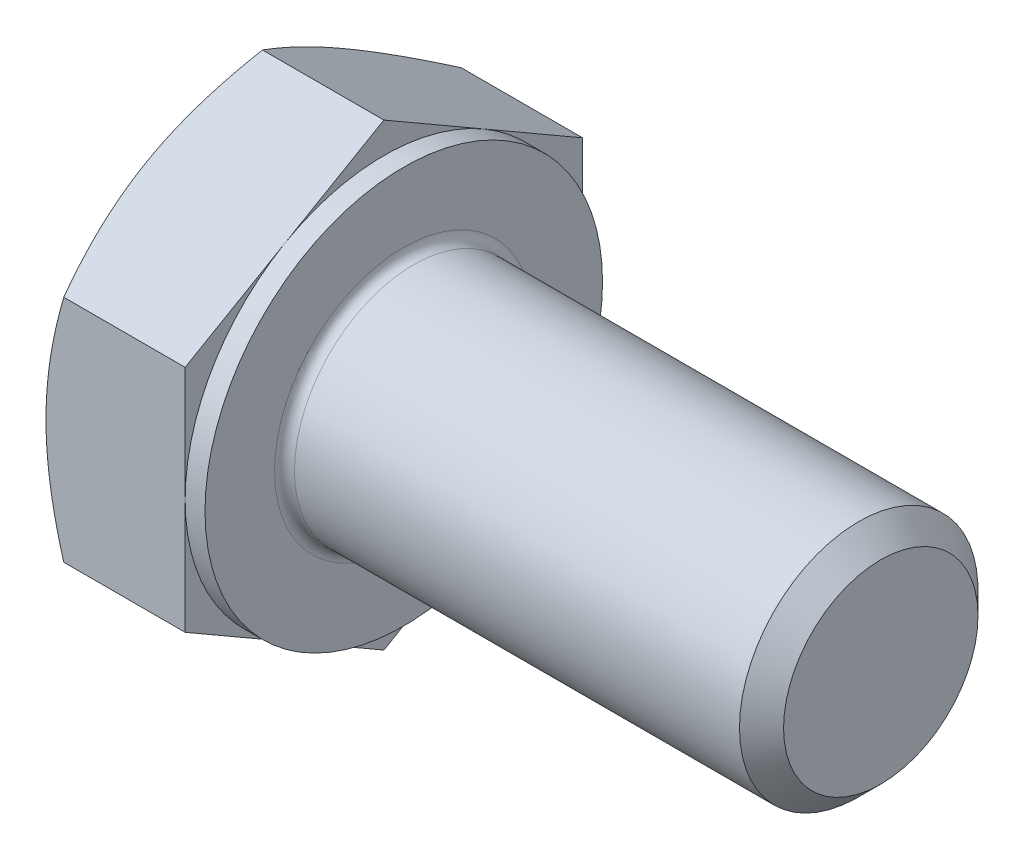
ISO-10303-21;
HEADER;
FILE_DESCRIPTION(('STEP AP214'),'2;1');
FILE_NAME('part.step','',(''),(''),'','','');
FILE_SCHEMA(('AUTOMOTIVE_DESIGN { 1 0 10303 214 1 1 1 1 }'));
ENDSEC;
DATA;
#1=APPLICATION_CONTEXT('core data for automotive mechanical design processes');
#2=APPLICATION_PROTOCOL_DEFINITION('international standard','automotive_design',2000,#1);
#3=PRODUCT_CONTEXT('',#1,'mechanical');
#4=PRODUCT('Part','Part','',(#3));
#5=PRODUCT_RELATED_PRODUCT_CATEGORY('part','',(#4));
#6=PRODUCT_DEFINITION_FORMATION('','',#4);
#7=PRODUCT_DEFINITION_CONTEXT('part definition',#1,'design');
#8=PRODUCT_DEFINITION('design','',#6,#7);
#9=PRODUCT_DEFINITION_SHAPE('','',#8);
#10=(LENGTH_UNIT() NAMED_UNIT(*) SI_UNIT(.MILLI.,.METRE.));
#11=(NAMED_UNIT(*) PLANE_ANGLE_UNIT() SI_UNIT($,.RADIAN.));
#12=(NAMED_UNIT(*) SI_UNIT($,.STERADIAN.) SOLID_ANGLE_UNIT());
#13=UNCERTAINTY_MEASURE_WITH_UNIT(LENGTH_MEASURE(1.E-05),#10,'distance_accuracy_value','');
#14=(GEOMETRIC_REPRESENTATION_CONTEXT(3) GLOBAL_UNCERTAINTY_ASSIGNED_CONTEXT((#13)) GLOBAL_UNIT_ASSIGNED_CONTEXT((#10,
#11,#12)) REPRESENTATION_CONTEXT('',''));
#15=CARTESIAN_POINT('',(0.,0.,0.));
#16=DIRECTION('',(0.,0.,1.));
#17=DIRECTION('',(1.,0.,0.));
#18=AXIS2_PLACEMENT_3D('',#15,#16,#17);
#19=CARTESIAN_POINT('',(4.,0.,-9.99999999999999));
#20=DIRECTION('',(1.,0.,0.));
#21=DIRECTION('',(0.,0.,-1.));
#22=AXIS2_PLACEMENT_3D('',#19,#20,#21);
#23=PLANE('',#22);
#24=CARTESIAN_POINT('',(4.,0.,0.));
#25=DIRECTION('',(1.,0.,0.));
#26=DIRECTION('',(0.,0.,-1.));
#27=AXIS2_PLACEMENT_3D('',#24,#25,#26);
#28=CIRCLE('',#27,3.25);
#29=CARTESIAN_POINT('',(4.,0.,-3.25));
#30=VERTEX_POINT('',#29);
#31=EDGE_CURVE('E46',#30,#30,#28,.F.);
#32=ORIENTED_EDGE('',*,*,#31,.T.);
#33=EDGE_LOOP('',(#32));
#34=FACE_BOUND('',#33,.T.);
#35=CARTESIAN_POINT('',(4.,0.,0.));
#36=DIRECTION('',(1.,0.,0.));
#37=DIRECTION('',(0.,0.,-1.));
#38=AXIS2_PLACEMENT_3D('',#35,#36,#37);
#39=CIRCLE('',#38,5.);
#40=CARTESIAN_POINT('',(4.,0.,-5.));
#41=VERTEX_POINT('',#40);
#42=EDGE_CURVE('E297',#41,#41,#39,.T.);
#43=ORIENTED_EDGE('',*,*,#42,.T.);
#44=EDGE_LOOP('',(#43));
#45=FACE_BOUND('',#44,.T.);
#46=ADVANCED_FACE('F38',(#34,#45),#23,.T.);
#47=CARTESIAN_POINT('',(0.,0.,0.));
#48=DIRECTION('',(-1.,0.,0.));
#49=DIRECTION('',(0.,0.,1.));
#50=AXIS2_PLACEMENT_3D('',#47,#48,#49);
#51=CYLINDRICAL_SURFACE('',#50,3.);
#52=CARTESIAN_POINT('',(4.25,0.,0.));
#53=DIRECTION('',(1.,0.,0.));
#54=DIRECTION('',(0.,0.,-1.));
#55=AXIS2_PLACEMENT_3D('',#52,#53,#54);
#56=CIRCLE('',#55,3.);
#57=CARTESIAN_POINT('',(4.25,0.,-3.));
#58=VERTEX_POINT('',#57);
#59=EDGE_CURVE('E11',#58,#58,#56,.T.);
#60=ORIENTED_EDGE('',*,*,#59,.T.);
#61=EDGE_LOOP('',(#60));
#62=FACE_BOUND('',#61,.T.);
#63=CARTESIAN_POINT('',(15.4455,0.,0.));
#64=DIRECTION('',(-1.,0.,0.));
#65=DIRECTION('',(0.,0.,1.));
#66=AXIS2_PLACEMENT_3D('',#63,#64,#65);
#67=CIRCLE('',#66,3.);
#68=CARTESIAN_POINT('',(15.4455,0.,3.));
#69=VERTEX_POINT('',#68);
#70=EDGE_CURVE('E276',#69,#69,#67,.T.);
#71=ORIENTED_EDGE('',*,*,#70,.T.);
#72=EDGE_LOOP('',(#71));
#73=FACE_BOUND('',#72,.T.);
#74=ADVANCED_FACE('F250',(#62,#73),#51,.T.);
#75=CARTESIAN_POINT('',(16.,0.,0.));
#76=DIRECTION('',(-1.,0.,0.));
#77=DIRECTION('',(0.,0.,1.));
#78=AXIS2_PLACEMENT_3D('',#75,#76,#77);
#79=CONICAL_SURFACE('',#78,2.4455,0.78539816339745);
#80=ORIENTED_EDGE('',*,*,#70,.F.);
#81=EDGE_LOOP('',(#80));
#82=FACE_BOUND('',#81,.T.);
#83=CARTESIAN_POINT('',(16.,0.,0.));
#84=DIRECTION('',(-1.,0.,0.));
#85=DIRECTION('',(0.,0.,1.));
#86=AXIS2_PLACEMENT_3D('',#83,#84,#85);
#87=CIRCLE('',#86,2.4455);
#88=CARTESIAN_POINT('',(16.,0.,2.4455));
#89=VERTEX_POINT('',#88);
#90=EDGE_CURVE('E274',#89,#89,#87,.T.);
#91=ORIENTED_EDGE('',*,*,#90,.T.);
#92=EDGE_LOOP('',(#91));
#93=FACE_BOUND('',#92,.T.);
#94=ADVANCED_FACE('F255',(#82,#93),#79,.T.);
#95=CARTESIAN_POINT('',(16.,0.,0.));
#96=DIRECTION('',(-1.,0.,0.));
#97=DIRECTION('',(0.,0.,1.));
#98=AXIS2_PLACEMENT_3D('',#95,#96,#97);
#99=PLANE('',#98);
#100=ORIENTED_EDGE('',*,*,#90,.F.);
#101=EDGE_LOOP('',(#100));
#102=FACE_BOUND('',#101,.T.);
#103=ADVANCED_FACE('F262',(#102),#99,.F.);
#104=CARTESIAN_POINT('',(3.5,5.,0.));
#105=DIRECTION('',(1.,0.,0.));
#106=DIRECTION('',(0.,0.,-1.));
#107=AXIS2_PLACEMENT_3D('',#104,#105,#106);
#108=PLANE('',#107);
#109=DIRECTION('',(0.,0.500000000000001,0.866025403784438));
#110=VECTOR('',#109,1.);
#111=CARTESIAN_POINT('',(3.5,2.88675134594813,-5.));
#112=LINE('',#111,#110);
#113=CARTESIAN_POINT('',(3.5,2.88675134594813,-5.));
#114=VERTEX_POINT('',#113);
#115=CARTESIAN_POINT('',(3.5,4.33012701892219,-2.50000000000001));
#116=VERTEX_POINT('',#115);
#117=EDGE_CURVE('E170',#114,#116,#112,.T.);
#118=ORIENTED_EDGE('',*,*,#117,.T.);
#119=CARTESIAN_POINT('',(3.5,0.,0.));
#120=DIRECTION('',(-1.,0.,0.));
#121=DIRECTION('',(0.,0.,1.));
#122=AXIS2_PLACEMENT_3D('',#119,#120,#121);
#123=CIRCLE('',#122,5.);
#124=CARTESIAN_POINT('',(3.5,0.,-5.));
#125=VERTEX_POINT('',#124);
#126=EDGE_CURVE('E53',#116,#125,#123,.T.);
#127=ORIENTED_EDGE('',*,*,#126,.T.);
#128=DIRECTION('',(0.,1.,0.));
#129=VECTOR('',#128,1.);
#130=CARTESIAN_POINT('',(3.5,2.88675134594813,-5.));
#131=LINE('',#130,#129);
#132=EDGE_CURVE('E300',#125,#114,#131,.T.);
#133=ORIENTED_EDGE('',*,*,#132,.T.);
#134=EDGE_LOOP('',(#118,#127,#133));
#135=FACE_BOUND('',#134,.T.);
#136=ADVANCED_FACE('F265',(#135),#108,.T.);
#137=CARTESIAN_POINT('',(3.5,5.77350269189626,0.));
#138=VERTEX_POINT('',#137);
#139=EDGE_CURVE('E168',#116,#138,#112,.T.);
#140=ORIENTED_EDGE('',*,*,#139,.T.);
#141=DIRECTION('',(0.,-0.500000000000001,0.866025403784438));
#142=VECTOR('',#141,1.);
#143=CARTESIAN_POINT('',(3.5,5.77350269189626,0.));
#144=LINE('',#143,#142);
#145=CARTESIAN_POINT('',(3.5,4.33012701892219,2.5));
#146=VERTEX_POINT('',#145);
#147=EDGE_CURVE('E167',#138,#146,#144,.T.);
#148=ORIENTED_EDGE('',*,*,#147,.T.);
#149=EDGE_CURVE('E156',#146,#116,#123,.T.);
#150=ORIENTED_EDGE('',*,*,#149,.T.);
#151=EDGE_LOOP('',(#140,#148,#150));
#152=FACE_BOUND('',#151,.T.);
#153=ADVANCED_FACE('F270',(#152),#108,.T.);
#154=CARTESIAN_POINT('',(3.5,2.88675134594812,5.));
#155=VERTEX_POINT('',#154);
#156=EDGE_CURVE('E135',#146,#155,#144,.T.);
#157=ORIENTED_EDGE('',*,*,#156,.T.);
#158=DIRECTION('',(0.,-1.,0.));
#159=VECTOR('',#158,1.);
#160=CARTESIAN_POINT('',(3.5,2.88675134594812,5.));
#161=LINE('',#160,#159);
#162=CARTESIAN_POINT('',(3.5,0.,5.));
#163=VERTEX_POINT('',#162);
#164=EDGE_CURVE('E129',#155,#163,#161,.T.);
#165=ORIENTED_EDGE('',*,*,#164,.T.);
#166=EDGE_CURVE('E133',#163,#146,#123,.T.);
#167=ORIENTED_EDGE('',*,*,#166,.T.);
#168=EDGE_LOOP('',(#157,#165,#167));
#169=FACE_BOUND('',#168,.T.);
#170=ADVANCED_FACE('F131',(#169),#108,.T.);
#171=CARTESIAN_POINT('',(3.5,-2.88675134594814,5.));
#172=VERTEX_POINT('',#171);
#173=EDGE_CURVE('E139',#163,#172,#161,.T.);
#174=ORIENTED_EDGE('',*,*,#173,.T.);
#175=DIRECTION('',(0.,-0.500000000000001,-0.866025403784438));
#176=VECTOR('',#175,1.);
#177=CARTESIAN_POINT('',(3.5,-5.77350269189627,0.));
#178=LINE('',#177,#176);
#179=CARTESIAN_POINT('',(3.5,-4.33012701892219,2.50000000000001));
#180=VERTEX_POINT('',#179);
#181=EDGE_CURVE('E146',#172,#180,#178,.T.);
#182=ORIENTED_EDGE('',*,*,#181,.T.);
#183=EDGE_CURVE('E143',#180,#163,#123,.T.);
#184=ORIENTED_EDGE('',*,*,#183,.T.);
#185=EDGE_LOOP('',(#174,#182,#184));
#186=FACE_BOUND('',#185,.T.);
#187=ADVANCED_FACE('F144',(#186),#108,.T.);
#188=CARTESIAN_POINT('',(3.5,-5.77350269189627,0.));
#189=VERTEX_POINT('',#188);
#190=EDGE_CURVE('E162',#180,#189,#178,.T.);
#191=ORIENTED_EDGE('',*,*,#190,.T.);
#192=DIRECTION('',(0.,0.500000000000001,-0.866025403784438));
#193=VECTOR('',#192,1.);
#194=CARTESIAN_POINT('',(3.5,-2.88675134594814,-5.));
#195=LINE('',#194,#193);
#196=CARTESIAN_POINT('',(3.5,-4.33012701892219,-2.50000000000001));
#197=VERTEX_POINT('',#196);
#198=EDGE_CURVE('E338',#189,#197,#195,.T.);
#199=ORIENTED_EDGE('',*,*,#198,.T.);
#200=EDGE_CURVE('E150',#197,#180,#123,.T.);
#201=ORIENTED_EDGE('',*,*,#200,.T.);
#202=EDGE_LOOP('',(#191,#199,#201));
#203=FACE_BOUND('',#202,.T.);
#204=ADVANCED_FACE('F339',(#203),#108,.T.);
#205=CARTESIAN_POINT('',(3.5,-2.88675134594814,-5.));
#206=VERTEX_POINT('',#205);
#207=EDGE_CURVE('E157',#197,#206,#195,.T.);
#208=ORIENTED_EDGE('',*,*,#207,.T.);
#209=EDGE_CURVE('E301',#206,#125,#131,.T.);
#210=ORIENTED_EDGE('',*,*,#209,.T.);
#211=EDGE_CURVE('E308',#125,#197,#123,.T.);
#212=ORIENTED_EDGE('',*,*,#211,.T.);
#213=EDGE_LOOP('',(#208,#210,#212));
#214=FACE_BOUND('',#213,.T.);
#215=ADVANCED_FACE('F271',(#214),#108,.T.);
#216=CARTESIAN_POINT('',(0.,0.,0.));
#217=DIRECTION('',(-1.,0.,0.));
#218=DIRECTION('',(0.,0.,1.));
#219=AXIS2_PLACEMENT_3D('',#216,#217,#218);
#220=CYLINDRICAL_SURFACE('',#219,5.);
#221=ORIENTED_EDGE('',*,*,#126,.F.);
#222=ORIENTED_EDGE('',*,*,#149,.F.);
#223=ORIENTED_EDGE('',*,*,#166,.F.);
#224=ORIENTED_EDGE('',*,*,#183,.F.);
#225=ORIENTED_EDGE('',*,*,#200,.F.);
#226=ORIENTED_EDGE('',*,*,#211,.F.);
#227=EDGE_LOOP('',(#221,#222,#223,#224,#225,#226));
#228=FACE_BOUND('',#227,.T.);
#229=ORIENTED_EDGE('',*,*,#42,.F.);
#230=EDGE_LOOP('',(#229));
#231=FACE_BOUND('',#230,.T.);
#232=ADVANCED_FACE('F153',(#228,#231),#220,.T.);
#233=CARTESIAN_POINT('',(0.,0.,-9.99999999999999));
#234=DIRECTION('',(1.,0.,0.));
#235=DIRECTION('',(0.,0.,-1.));
#236=AXIS2_PLACEMENT_3D('',#233,#234,#235);
#237=PLANE('',#236);
#238=CARTESIAN_POINT('',(0.,0.,0.));
#239=DIRECTION('',(1.,0.,0.));
#240=DIRECTION('',(0.,0.,-1.));
#241=AXIS2_PLACEMENT_3D('',#238,#239,#240);
#242=CIRCLE('',#241,5.);
#243=CARTESIAN_POINT('',(0.,0.,-5.));
#244=VERTEX_POINT('',#243);
#245=CARTESIAN_POINT('',(0.,4.33012701892219,-2.50000000000001));
#246=VERTEX_POINT('',#245);
#247=EDGE_CURVE('E296',#244,#246,#242,.T.);
#248=ORIENTED_EDGE('',*,*,#247,.F.);
#249=CARTESIAN_POINT('',(0.,-4.33012701892219,-2.50000000000001));
#250=VERTEX_POINT('',#249);
#251=EDGE_CURVE('E292',#250,#244,#242,.T.);
#252=ORIENTED_EDGE('',*,*,#251,.F.);
#253=CARTESIAN_POINT('',(0.,-4.33012701892219,2.50000000000001));
#254=VERTEX_POINT('',#253);
#255=EDGE_CURVE('E295',#254,#250,#242,.T.);
#256=ORIENTED_EDGE('',*,*,#255,.F.);
#257=CARTESIAN_POINT('',(0.,0.,5.));
#258=VERTEX_POINT('',#257);
#259=EDGE_CURVE('E331',#258,#254,#242,.T.);
#260=ORIENTED_EDGE('',*,*,#259,.F.);
#261=CARTESIAN_POINT('',(0.,0.,0.));
#262=DIRECTION('',(-1.,0.,0.));
#263=DIRECTION('',(0.,0.,1.));
#264=AXIS2_PLACEMENT_3D('',#261,#262,#263);
#265=CIRCLE('',#264,5.);
#266=CARTESIAN_POINT('',(0.,4.33012701892219,2.5));
#267=VERTEX_POINT('',#266);
#268=EDGE_CURVE('E171',#258,#267,#265,.T.);
#269=ORIENTED_EDGE('',*,*,#268,.T.);
#270=EDGE_CURVE('E354',#246,#267,#242,.T.);
#271=ORIENTED_EDGE('',*,*,#270,.F.);
#272=EDGE_LOOP('',(#248,#252,#256,#260,#269,#271));
#273=FACE_BOUND('',#272,.T.);
#274=ADVANCED_FACE('F200',(#273),#237,.F.);
#275=CARTESIAN_POINT('',(0.,0.,0.));
#276=DIRECTION('',(1.,0.,0.));
#277=DIRECTION('',(0.,0.,-1.));
#278=AXIS2_PLACEMENT_3D('',#275,#276,#277);
#279=CONICAL_SURFACE('',#278,5.,1.0471975511966);
#280=CARTESIAN_POINT('',(0.446648656051827,2.88663587589429,5.0002));
#281=CARTESIAN_POINT('',(0.373386567637633,3.01349970319368,4.78046540547482));
#282=CARTESIAN_POINT('',(0.30675132191809,3.14144859993849,4.55885141554042));
#283=CARTESIAN_POINT('',(0.19043899101081,3.3995619353212,4.11178600454649));
#284=CARTESIAN_POINT('',(0.140803049915788,3.52973095989717,3.88632664040923));
#285=CARTESIAN_POINT('',(0.0635510254186972,3.78847564779797,3.43816769477649));
#286=CARTESIAN_POINT('',(0.0354203782834881,3.91701101576052,3.21553790689581));
#287=CARTESIAN_POINT('',(0.0101949219536836,4.11026620624322,2.88081009815336));
#288=CARTESIAN_POINT('',(0.00461345976948329,4.1747286887931,2.76915780319494));
#289=CARTESIAN_POINT('',(-0.000797783248530234,4.30371322717528,2.54575002932621));
#290=CARTESIAN_POINT('',(-0.000627741741797061,4.36823528110588,2.43399455370969));
#291=CARTESIAN_POINT('',(0.0077536317920362,4.54500768479194,2.12781576914936));
#292=CARTESIAN_POINT('',(0.0218297718972513,4.65719946015292,1.93349391403279));
#293=CARTESIAN_POINT('',(0.066465257109431,4.88083840557981,1.5461398980023));
#294=CARTESIAN_POINT('',(0.0970398601475084,4.9922847895602,1.35310909862843));
#295=CARTESIAN_POINT('',(0.173468493621164,5.21637431361295,0.964974657525146));
#296=CARTESIAN_POINT('',(0.219646378878681,5.32898917185759,0.769920001358265));
#297=CARTESIAN_POINT('',(0.324451794491935,5.55253939626498,0.382719654641232));
#298=CARTESIAN_POINT('',(0.383054703437375,5.66347762579592,0.190569004591913));
#299=CARTESIAN_POINT('',(0.44664865605183,5.7736181619501,-0.000200000000000191));
#300=B_SPLINE_CURVE_WITH_KNOTS('',3,(#280,#281,#282,#283,#284,#285,#286,#287,#288,#289,#290,
#291,#292,#293,#294,#295,#296,#297,#298,#299),.UNSPECIFIED.,.F.,.F.,(4,2,2,2,2,2,2,2,2,4),(0.,
0.792555841363091,1.58701660053333,2.3618153748728,2.74884076077325,3.13585419177295,
3.80962362599679,4.48401723901189,5.17336882348929,5.86136694793726),.UNSPECIFIED.);
#301=CARTESIAN_POINT('',(0.446581987385203,5.77350269189626,0.));
#302=VERTEX_POINT('',#301);
#303=EDGE_CURVE('E219',#267,#302,#300,.T.);
#304=ORIENTED_EDGE('',*,*,#303,.T.);
#305=CARTESIAN_POINT('',(0.44664865605183,5.7736181619501,0.000200000000000014));
#306=CARTESIAN_POINT('',(0.373386567637636,5.64675433465071,-0.219534594525184));
#307=CARTESIAN_POINT('',(0.306751321918093,5.5188054379059,-0.44114858445958));
#308=CARTESIAN_POINT('',(0.190438991010811,5.26069210252318,-0.888213995453513));
#309=CARTESIAN_POINT('',(0.140803049915789,5.13052307794721,-1.11367335959077));
#310=CARTESIAN_POINT('',(0.0635510254186982,4.87177839004641,-1.56183230522351));
#311=CARTESIAN_POINT('',(0.0354203782834897,4.74324302208387,-1.78446209310419));
#312=CARTESIAN_POINT('',(0.0101949219536841,4.54998783160116,-2.11918990184664));
#313=CARTESIAN_POINT('',(0.00461345976948316,4.48552534905128,-2.23084219680506));
#314=CARTESIAN_POINT('',(-0.000797783248530588,4.35654081066911,-2.4542499706738));
#315=CARTESIAN_POINT('',(-0.000627741741797015,4.2920187567385,-2.56600544629031));
#316=CARTESIAN_POINT('',(0.00775363179203648,4.11524635305244,-2.87218423085064));
#317=CARTESIAN_POINT('',(0.0218297718972508,4.00305457769146,-3.06650608596721));
#318=CARTESIAN_POINT('',(0.0664652571094295,3.77941563226457,-3.45386010199771));
#319=CARTESIAN_POINT('',(0.0970398601475067,3.66796924828418,-3.64689090137157));
#320=CARTESIAN_POINT('',(0.173468493621162,3.44387972423144,-4.03502534247485));
#321=CARTESIAN_POINT('',(0.219646378878679,3.3312648659868,-4.23007999864174));
#322=CARTESIAN_POINT('',(0.324451794491932,3.1077146415794,-4.61728034535877));
#323=CARTESIAN_POINT('',(0.383054703437372,2.99677641204847,-4.80943099540809));
#324=CARTESIAN_POINT('',(0.446648656051826,2.88663587589429,-5.0002));
#325=B_SPLINE_CURVE_WITH_KNOTS('',3,(#305,#306,#307,#308,#309,#310,#311,#312,#313,#314,#315,
#316,#317,#318,#319,#320,#321,#322,#323,#324),.UNSPECIFIED.,.F.,.F.,(4,2,2,2,2,2,2,2,2,4),(0.,
0.792555841363091,1.58701660053333,2.36181537487281,2.74884076077325,3.13585419177295,
3.80962362599679,4.48401723901189,5.17336882348929,5.86136694793725),.UNSPECIFIED.);
#326=EDGE_CURVE('E61',#302,#246,#325,.T.);
#327=ORIENTED_EDGE('',*,*,#326,.T.);
#328=ORIENTED_EDGE('',*,*,#270,.T.);
#329=EDGE_LOOP('',(#304,#327,#328));
#330=FACE_BOUND('',#329,.T.);
#331=ADVANCED_FACE('F355',(#330),#279,.T.);
#332=CARTESIAN_POINT('',(2.47533544689296,-7.82661640313891,5.));
#333=CARTESIAN_POINT('',(2.36879683507774,-7.60758613024923,5.));
#334=CARTESIAN_POINT('',(2.26325911833057,-7.38806071364412,5.));
#335=CARTESIAN_POINT('',(2.05474707865951,-6.94775649535435,5.));
#336=CARTESIAN_POINT('',(1.95177314617003,-6.7269775089769,5.));
#337=CARTESIAN_POINT('',(1.74844778545275,-6.28280027125599,5.));
#338=CARTESIAN_POINT('',(1.64811306490869,-6.05939434592715,5.));
#339=CARTESIAN_POINT('',(1.45145486004313,-5.61083043832922,5.));
#340=CARTESIAN_POINT('',(1.35513119080618,-5.38567253739806,5.));
#341=CARTESIAN_POINT('',(1.16445037605961,-4.92576614780204,5.));
#342=CARTESIAN_POINT('',(1.07026351405996,-4.69094667859486,5.));
#343=CARTESIAN_POINT('',(0.888844387350843,-4.21858752735364,5.));
#344=CARTESIAN_POINT('',(0.801612892640665,-3.98104754746318,5.));
#345=CARTESIAN_POINT('',(0.636341071883244,-3.50329086404365,5.));
#346=CARTESIAN_POINT('',(0.558282765149715,-3.26308044250488,5.));
#347=CARTESIAN_POINT('',(0.413813856737668,-2.77921467819533,5.));
#348=CARTESIAN_POINT('',(0.347399663631978,-2.53556042276,5.));
#349=CARTESIAN_POINT('',(0.229707450535054,-2.04600448312504,5.));
#350=CARTESIAN_POINT('',(0.178346573442481,-1.80012308686185,5.));
#351=CARTESIAN_POINT('',(0.0936230804935169,-1.30522837494366,5.));
#352=CARTESIAN_POINT('',(0.0602585789244935,-1.05621539022479,5.));
#353=CARTESIAN_POINT('',(0.0146229933804848,-0.559584253783077,5.));
#354=CARTESIAN_POINT('',(0.00207498506584135,-0.311992192967684,5.));
#355=CARTESIAN_POINT('',(-0.00159747165030497,0.18337558405673,5.));
#356=CARTESIAN_POINT('',(0.00727849448086255,0.431151303726632,5.));
#357=CARTESIAN_POINT('',(0.0397265053205839,0.849622860758219,5.));
#358=CARTESIAN_POINT('',(0.0579847912618789,1.02075746544155,5.));
#359=CARTESIAN_POINT('',(0.103624049996721,1.36181398757519,5.));
#360=CARTESIAN_POINT('',(0.131006199082923,1.5317357457727,5.));
#361=CARTESIAN_POINT('',(0.22540333381632,2.03942834541586,5.));
#362=CARTESIAN_POINT('',(0.304653621104034,2.37495177168562,5.));
#363=CARTESIAN_POINT('',(0.442611792168636,2.8768600602015,5.));
#364=CARTESIAN_POINT('',(0.492453035928113,3.04583048582564,5.));
#365=CARTESIAN_POINT('',(0.597441969480137,3.38213061038657,5.));
#366=CARTESIAN_POINT('',(0.652589698776802,3.54946029709868,5.));
#367=CARTESIAN_POINT('',(0.767295730006393,3.88253122341816,5.));
#368=CARTESIAN_POINT('',(0.82685271313781,4.04827292137363,5.));
#369=CARTESIAN_POINT('',(0.949663499110046,4.37837269604182,5.));
#370=CARTESIAN_POINT('',(1.01291722636637,4.54273080096525,5.));
#371=CARTESIAN_POINT('',(1.18384085306905,4.97467594039768,5.));
#372=CARTESIAN_POINT('',(1.29410564783452,5.24123504256647,5.));
#373=CARTESIAN_POINT('',(1.52085041203992,5.77170603526333,5.));
#374=CARTESIAN_POINT('',(1.63733099805396,6.03561766007927,5.));
#375=CARTESIAN_POINT('',(1.87507624393348,6.56138078778336,5.));
#376=CARTESIAN_POINT('',(1.99634255328237,6.82323154239328,5.));
#377=CARTESIAN_POINT('',(2.24254703861692,7.34518395602015,5.));
#378=CARTESIAN_POINT('',(2.36748508200602,7.60528567778374,5.));
#379=CARTESIAN_POINT('',(2.62044102887898,8.12446478659922,5.));
#380=CARTESIAN_POINT('',(2.74846325062126,8.38354006552433,5.));
#381=CARTESIAN_POINT('',(3.00682668967549,8.9005329112754,5.));
#382=CARTESIAN_POINT('',(3.13716793074432,9.15845046620729,5.));
#383=CARTESIAN_POINT('',(3.53092424591317,9.93067662274979,5.));
#384=CARTESIAN_POINT('',(3.79712405172275,10.4435647238032,5.));
#385=CARTESIAN_POINT('',(4.30724046881171,11.4147548711532,5.));
#386=CARTESIAN_POINT('',(4.55067498762245,11.873311348306,5.));
#387=CARTESIAN_POINT('',(5.04052915785298,12.7888590468283,5.));
#388=CARTESIAN_POINT('',(5.28694897482744,13.2458501795696,5.));
#389=CARTESIAN_POINT('',(5.7812250534644,14.1571829390174,5.));
#390=CARTESIAN_POINT('',(6.02907430461245,14.6115283739736,5.));
#391=CARTESIAN_POINT('',(6.52648185519851,15.5192398746589,5.));
#392=CARTESIAN_POINT('',(6.77604002809907,15.9726060096992,5.));
#393=CARTESIAN_POINT('',(7.02622264559118,16.4256251044156,5.));
#394=B_SPLINE_CURVE_WITH_KNOTS('',3,(#332,#333,#334,#335,#336,#337,#338,#339,#340,#341,#342,
#343,#344,#345,#346,#347,#348,#349,#350,#351,#352,#353,#354,#355,#356,#357,#358,#359,#360,#361,
#362,#363,#364,#365,#366,#367,#368,#369,#370,#371,#372,#373,#374,#375,#376,#377,#378,#379,#380,
#381,#382,#383,#384,#385,#386,#387,#388,#389,#390,#391,#392,#393),.UNSPECIFIED.,.F.,.F.,(4,2,2,
2,2,2,2,2,2,2,2,2,2,2,2,2,2,2,2,2,2,2,2,2,2,2,2,2,2,2,4),(0.,0.730708682143098,1.46152797033751,
2.19620403652929,2.930846195478,3.68977491658214,4.44878753915767,5.20628666210828,
5.9635517348485,6.71656679485873,7.46950293642268,8.21233991237301,8.95519126159775,
9.4712599123247,9.98739512288343,11.0201893937443,11.5486465414698,12.0771076235976,
12.6054112774226,13.1337041332035,13.9989833719716,14.8643486020619,15.7300147459346,
16.5956496665092,17.4625765068272,18.3295122333794,20.0630293163822,21.6205191219182,
23.1780956996636,24.7307447704824,26.2832800921359),.UNSPECIFIED.);
#395=CARTESIAN_POINT('',(0.446581987385201,2.88675134594813,5.));
#396=VERTEX_POINT('',#395);
#397=EDGE_CURVE('E231',#258,#396,#394,.T.);
#398=ORIENTED_EDGE('',*,*,#397,.T.);
#399=EDGE_CURVE('E230',#396,#267,#300,.T.);
#400=ORIENTED_EDGE('',*,*,#399,.T.);
#401=ORIENTED_EDGE('',*,*,#268,.F.);
#402=EDGE_LOOP('',(#398,#400,#401));
#403=FACE_BOUND('',#402,.T.);
#404=ADVANCED_FACE('F325',(#403),#279,.T.);
#405=CARTESIAN_POINT('',(0.446581987385204,-2.88675134594814,5.));
#406=VERTEX_POINT('',#405);
#407=EDGE_CURVE('E277',#406,#258,#394,.T.);
#408=ORIENTED_EDGE('',*,*,#407,.T.);
#409=ORIENTED_EDGE('',*,*,#259,.T.);
#410=CARTESIAN_POINT('',(0.446648656051838,-5.77361816195011,-0.00019999999999995));
#411=CARTESIAN_POINT('',(0.373386567637643,-5.64675433465072,0.219534594525185));
#412=CARTESIAN_POINT('',(0.3067513219181,-5.51880543790591,0.441148584459581));
#413=CARTESIAN_POINT('',(0.190438991010818,-5.26069210252319,0.888213995453515));
#414=CARTESIAN_POINT('',(0.140803049915796,-5.13052307794722,1.11367335959078));
#415=CARTESIAN_POINT('',(0.0635510254187046,-4.87177839004642,1.56183230522351));
#416=CARTESIAN_POINT('',(0.0354203782834955,-4.74324302208388,1.7844620931042));
#417=CARTESIAN_POINT('',(0.0101949219536906,-4.54998783160117,2.11918990184665));
#418=CARTESIAN_POINT('',(0.00461345976949019,-4.48552534905129,2.23084219680507));
#419=CARTESIAN_POINT('',(-0.000797783248523588,-4.35654081066912,2.4542499706738));
#420=CARTESIAN_POINT('',(-0.000627741741790562,-4.29201875673851,2.56600544629032));
#421=CARTESIAN_POINT('',(0.00775363179204238,-4.11524635305245,2.87218423085064));
#422=CARTESIAN_POINT('',(0.0218297718972574,-4.00305457769147,3.06650608596722));
#423=CARTESIAN_POINT('',(0.0664652571094361,-3.77941563226458,3.45386010199771));
#424=CARTESIAN_POINT('',(0.0970398601475128,-3.66796924828419,3.64689090137157));
#425=CARTESIAN_POINT('',(0.173468493621168,-3.44387972423145,4.03502534247486));
#426=CARTESIAN_POINT('',(0.219646378878684,-3.33126486598681,4.23007999864174));
#427=CARTESIAN_POINT('',(0.324451794491937,-3.10771464157941,4.61728034535877));
#428=CARTESIAN_POINT('',(0.383054703437377,-2.99677641204848,4.80943099540809));
#429=CARTESIAN_POINT('',(0.44664865605183,-2.8866358758943,5.0002));
#430=B_SPLINE_CURVE_WITH_KNOTS('',3,(#410,#411,#412,#413,#414,#415,#416,#417,#418,#419,#420,
#421,#422,#423,#424,#425,#426,#427,#428,#429),.UNSPECIFIED.,.F.,.F.,(4,2,2,2,2,2,2,2,2,4),(0.,
0.792555841363093,1.58701660053334,2.36181537487281,2.74884076077326,3.13585419177296,
3.8096236259968,4.4840172390119,5.17336882348929,5.86136694793726),.UNSPECIFIED.);
#431=EDGE_CURVE('E221',#254,#406,#430,.T.);
#432=ORIENTED_EDGE('',*,*,#431,.T.);
#433=EDGE_LOOP('',(#408,#409,#432));
#434=FACE_BOUND('',#433,.T.);
#435=ADVANCED_FACE('F189',(#434),#279,.T.);
#436=CARTESIAN_POINT('',(0.446581987385211,-5.77350269189627,0.));
#437=VERTEX_POINT('',#436);
#438=EDGE_CURVE('E214',#437,#254,#430,.T.);
#439=ORIENTED_EDGE('',*,*,#438,.T.);
#440=ORIENTED_EDGE('',*,*,#255,.T.);
#441=CARTESIAN_POINT('',(0.44664865605183,-2.8866358758943,-5.0002));
#442=CARTESIAN_POINT('',(0.373386567637636,-3.01349970319369,-4.78046540547481));
#443=CARTESIAN_POINT('',(0.306751321918094,-3.1414485999385,-4.55885141554042));
#444=CARTESIAN_POINT('',(0.190438991010813,-3.39956193532122,-4.11178600454648));
#445=CARTESIAN_POINT('',(0.140803049915792,-3.52973095989719,-3.88632664040922));
#446=CARTESIAN_POINT('',(0.0635510254187016,-3.78847564779799,-3.43816769477649));
#447=CARTESIAN_POINT('',(0.0354203782834936,-3.91701101576053,-3.2155379068958));
#448=CARTESIAN_POINT('',(0.010194921953689,-4.11026620624324,-2.88081009815336));
#449=CARTESIAN_POINT('',(0.00461345976948846,-4.17472868879312,-2.76915780319494));
#450=CARTESIAN_POINT('',(-0.000797783248524622,-4.30371322717529,-2.5457500293262));
#451=CARTESIAN_POINT('',(-0.000627741741790787,-4.3682352811059,-2.43399455370968));
#452=CARTESIAN_POINT('',(0.00775363179204349,-4.54500768479196,-2.12781576914936));
#453=CARTESIAN_POINT('',(0.0218297718972584,-4.65719946015294,-1.93349391403279));
#454=CARTESIAN_POINT('',(0.0664652571094381,-4.88083840557983,-1.54613989800229));
#455=CARTESIAN_POINT('',(0.0970398601475157,-4.99228478956022,-1.35310909862843));
#456=CARTESIAN_POINT('',(0.173468493621172,-5.21637431361296,-0.964974657525146));
#457=CARTESIAN_POINT('',(0.219646378878688,-5.3289891718576,-0.769920001358265));
#458=CARTESIAN_POINT('',(0.324451794491942,-5.552539396265,-0.382719654641232));
#459=CARTESIAN_POINT('',(0.383054703437383,-5.66347762579593,-0.190569004591914));
#460=CARTESIAN_POINT('',(0.446648656051837,-5.77361816195011,0.000199999999999246));
#461=B_SPLINE_CURVE_WITH_KNOTS('',3,(#441,#442,#443,#444,#445,#446,#447,#448,#449,#450,#451,
#452,#453,#454,#455,#456,#457,#458,#459,#460),.UNSPECIFIED.,.F.,.F.,(4,2,2,2,2,2,2,2,2,4),(0.,
0.792555841363092,1.58701660053334,2.36181537487281,2.74884076077326,3.13585419177295,
3.80962362599679,4.48401723901189,5.17336882348929,5.86136694793725),.UNSPECIFIED.);
#462=EDGE_CURVE('E220',#250,#437,#461,.T.);
#463=ORIENTED_EDGE('',*,*,#462,.T.);
#464=EDGE_LOOP('',(#439,#440,#463));
#465=FACE_BOUND('',#464,.T.);
#466=ADVANCED_FACE('F353',(#465),#279,.T.);
#467=CARTESIAN_POINT('',(0.4465819873852,2.88675134594813,-5.));
#468=VERTEX_POINT('',#467);
#469=EDGE_CURVE('E222',#246,#468,#325,.T.);
#470=ORIENTED_EDGE('',*,*,#469,.T.);
#471=CARTESIAN_POINT('',(2.47533544689296,-7.82661640313891,-5.));
#472=CARTESIAN_POINT('',(2.36879683507774,-7.60758613024923,-5.));
#473=CARTESIAN_POINT('',(2.26325911833057,-7.38806071364412,-5.));
#474=CARTESIAN_POINT('',(2.05474707865951,-6.94775649535435,-5.));
#475=CARTESIAN_POINT('',(1.95177314617003,-6.7269775089769,-5.));
#476=CARTESIAN_POINT('',(1.74844778545275,-6.28280027125599,-5.));
#477=CARTESIAN_POINT('',(1.64811306490869,-6.05939434592715,-5.));
#478=CARTESIAN_POINT('',(1.45145486004312,-5.61083043832922,-5.));
#479=CARTESIAN_POINT('',(1.35513119080618,-5.38567253739806,-5.));
#480=CARTESIAN_POINT('',(1.16445037605961,-4.92576614780204,-5.));
#481=CARTESIAN_POINT('',(1.07026351405996,-4.69094667859486,-5.));
#482=CARTESIAN_POINT('',(0.888844387350841,-4.21858752735364,-5.));
#483=CARTESIAN_POINT('',(0.801612892640663,-3.98104754746318,-5.));
#484=CARTESIAN_POINT('',(0.636341071883243,-3.50329086404365,-5.));
#485=CARTESIAN_POINT('',(0.558282765149713,-3.26308044250488,-5.));
#486=CARTESIAN_POINT('',(0.413813856737667,-2.77921467819533,-5.));
#487=CARTESIAN_POINT('',(0.347399663631977,-2.53556042276,-5.));
#488=CARTESIAN_POINT('',(0.229707450535053,-2.04600448312504,-5.));
#489=CARTESIAN_POINT('',(0.178346573442479,-1.80012308686184,-5.));
#490=CARTESIAN_POINT('',(0.0936230804935155,-1.30522837494366,-5.));
#491=CARTESIAN_POINT('',(0.0602585789244924,-1.05621539022478,-5.));
#492=CARTESIAN_POINT('',(0.014622993380484,-0.559584253783075,-5.));
#493=CARTESIAN_POINT('',(0.00207498506584052,-0.311992192967683,-5.));
#494=CARTESIAN_POINT('',(-0.00159747165030615,0.18337558405673,-5.));
#495=CARTESIAN_POINT('',(0.00727849448086107,0.431151303726633,-5.));
#496=CARTESIAN_POINT('',(0.0397265053205823,0.849622860758219,-5.));
#497=CARTESIAN_POINT('',(0.0579847912618774,1.02075746544155,-5.));
#498=CARTESIAN_POINT('',(0.10362404999672,1.36181398757518,-5.));
#499=CARTESIAN_POINT('',(0.131006199082922,1.5317357457727,-5.));
#500=CARTESIAN_POINT('',(0.225403333816319,2.03942834541585,-5.));
#501=CARTESIAN_POINT('',(0.304653621104033,2.37495177168562,-5.));
#502=CARTESIAN_POINT('',(0.442611792168635,2.8768600602015,-5.));
#503=CARTESIAN_POINT('',(0.492453035928112,3.04583048582564,-5.));
#504=CARTESIAN_POINT('',(0.597441969480135,3.38213061038657,-5.));
#505=CARTESIAN_POINT('',(0.6525896987768,3.54946029709868,-5.));
#506=CARTESIAN_POINT('',(0.767295730006391,3.88253122341816,-5.));
#507=CARTESIAN_POINT('',(0.826852713137809,4.04827292137363,-5.));
#508=CARTESIAN_POINT('',(0.949663499110045,4.37837269604182,-5.));
#509=CARTESIAN_POINT('',(1.01291722636636,4.54273080096525,-5.));
#510=CARTESIAN_POINT('',(1.18384085306904,4.97467594039768,-5.));
#511=CARTESIAN_POINT('',(1.29410564783452,5.24123504256647,-5.));
#512=CARTESIAN_POINT('',(1.52085041203992,5.77170603526333,-5.));
#513=CARTESIAN_POINT('',(1.63733099805396,6.03561766007927,-5.));
#514=CARTESIAN_POINT('',(1.87507624393348,6.56138078778336,-5.));
#515=CARTESIAN_POINT('',(1.99634255328237,6.82323154239328,-5.));
#516=CARTESIAN_POINT('',(2.24254703861692,7.34518395602014,-5.));
#517=CARTESIAN_POINT('',(2.36748508200601,7.60528567778373,-5.));
#518=CARTESIAN_POINT('',(2.62044102887897,8.12446478659921,-5.));
#519=CARTESIAN_POINT('',(2.74846325062125,8.38354006552432,-5.));
#520=CARTESIAN_POINT('',(3.00682668967549,8.9005329112754,-5.));
#521=CARTESIAN_POINT('',(3.13716793074432,9.15845046620728,-5.));
#522=CARTESIAN_POINT('',(3.53092424591316,9.93067662274979,-5.));
#523=CARTESIAN_POINT('',(3.79712405172275,10.4435647238032,-5.));
#524=CARTESIAN_POINT('',(4.30724046881171,11.4147548711532,-5.));
#525=CARTESIAN_POINT('',(4.55067498762245,11.873311348306,-5.));
#526=CARTESIAN_POINT('',(5.04052915785298,12.7888590468283,-5.));
#527=CARTESIAN_POINT('',(5.28694897482744,13.2458501795696,-5.));
#528=CARTESIAN_POINT('',(5.7812250534644,14.1571829390174,-5.));
#529=CARTESIAN_POINT('',(6.02907430461245,14.6115283739736,-5.));
#530=CARTESIAN_POINT('',(6.52648185519851,15.5192398746589,-5.));
#531=CARTESIAN_POINT('',(6.77604002809907,15.9726060096992,-5.));
#532=CARTESIAN_POINT('',(7.02622264559118,16.4256251044156,-5.));
#533=B_SPLINE_CURVE_WITH_KNOTS('',3,(#471,#472,#473,#474,#475,#476,#477,#478,#479,#480,#481,
#482,#483,#484,#485,#486,#487,#488,#489,#490,#491,#492,#493,#494,#495,#496,#497,#498,#499,#500,
#501,#502,#503,#504,#505,#506,#507,#508,#509,#510,#511,#512,#513,#514,#515,#516,#517,#518,#519,
#520,#521,#522,#523,#524,#525,#526,#527,#528,#529,#530,#531,#532),.UNSPECIFIED.,.F.,.F.,(4,2,2,
2,2,2,2,2,2,2,2,2,2,2,2,2,2,2,2,2,2,2,2,2,2,2,2,2,2,2,4),(0.,0.730708682143099,1.46152797033751,
2.19620403652929,2.930846195478,3.68977491658213,4.44878753915767,5.20628666210828,
5.9635517348485,6.71656679485873,7.46950293642268,8.21233991237301,8.95519126159775,
9.4712599123247,9.98739512288343,11.0201893937443,11.5486465414698,12.0771076235976,
12.6054112774226,13.1337041332035,13.9989833719716,14.8643486020619,15.7300147459346,
16.5956496665091,17.4625765068272,18.3295122333794,20.0630293163822,21.6205191219182,
23.1780956996636,24.7307447704824,26.2832800921359),.UNSPECIFIED.);
#534=EDGE_CURVE('E182',#468,#244,#533,.F.);
#535=ORIENTED_EDGE('',*,*,#534,.T.);
#536=ORIENTED_EDGE('',*,*,#247,.T.);
#537=EDGE_LOOP('',(#470,#535,#536));
#538=FACE_BOUND('',#537,.T.);
#539=ADVANCED_FACE('F350',(#538),#279,.T.);
#540=CARTESIAN_POINT('',(0.446581987384948,-2.88675134594852,-5.));
#541=VERTEX_POINT('',#540);
#542=EDGE_CURVE('E183',#541,#250,#461,.T.);
#543=ORIENTED_EDGE('',*,*,#542,.T.);
#544=ORIENTED_EDGE('',*,*,#251,.T.);
#545=EDGE_CURVE('E174',#244,#541,#533,.F.);
#546=ORIENTED_EDGE('',*,*,#545,.T.);
#547=EDGE_LOOP('',(#543,#544,#546));
#548=FACE_BOUND('',#547,.T.);
#549=ADVANCED_FACE('F198',(#548),#279,.T.);
#550=CARTESIAN_POINT('',(4.,2.88675134594813,-5.));
#551=DIRECTION('',(0.,0.,1.));
#552=DIRECTION('',(1.,0.,0.));
#553=AXIS2_PLACEMENT_3D('',#550,#551,#552);
#554=PLANE('',#553);
#555=ORIENTED_EDGE('',*,*,#209,.F.);
#556=DIRECTION('',(-1.,0.,0.));
#557=VECTOR('',#556,1.);
#558=CARTESIAN_POINT('',(4.,-2.88675134594814,-5.));
#559=LINE('',#558,#557);
#560=EDGE_CURVE('E283',#206,#541,#559,.T.);
#561=ORIENTED_EDGE('',*,*,#560,.T.);
#562=ORIENTED_EDGE('',*,*,#545,.F.);
#563=ORIENTED_EDGE('',*,*,#534,.F.);
#564=DIRECTION('',(-1.,0.,0.));
#565=VECTOR('',#564,1.);
#566=CARTESIAN_POINT('',(4.,2.88675134594813,-5.));
#567=LINE('',#566,#565);
#568=EDGE_CURVE('E279',#114,#468,#567,.T.);
#569=ORIENTED_EDGE('',*,*,#568,.F.);
#570=ORIENTED_EDGE('',*,*,#132,.F.);
#571=EDGE_LOOP('',(#555,#561,#562,#563,#569,#570));
#572=FACE_BOUND('',#571,.T.);
#573=ADVANCED_FACE('F193',(#572),#554,.F.);
#574=CARTESIAN_POINT('',(4.,-2.88675134594814,-5.));
#575=DIRECTION('',(0.,0.866025403784438,0.500000000000001));
#576=DIRECTION('',(0.,-0.500000000000001,0.866025403784438));
#577=AXIS2_PLACEMENT_3D('',#574,#575,#576);
#578=PLANE('',#577);
#579=ORIENTED_EDGE('',*,*,#198,.F.);
#580=DIRECTION('',(-1.,0.,0.));
#581=VECTOR('',#580,1.);
#582=CARTESIAN_POINT('',(4.,-5.77350269189627,0.));
#583=LINE('',#582,#581);
#584=EDGE_CURVE('E285',#189,#437,#583,.T.);
#585=ORIENTED_EDGE('',*,*,#584,.T.);
#586=ORIENTED_EDGE('',*,*,#462,.F.);
#587=ORIENTED_EDGE('',*,*,#542,.F.);
#588=ORIENTED_EDGE('',*,*,#560,.F.);
#589=ORIENTED_EDGE('',*,*,#207,.F.);
#590=EDGE_LOOP('',(#579,#585,#586,#587,#588,#589));
#591=FACE_BOUND('',#590,.T.);
#592=ADVANCED_FACE('F197',(#591),#578,.F.);
#593=CARTESIAN_POINT('',(4.,-5.77350269189627,0.));
#594=DIRECTION('',(0.,0.866025403784438,-0.500000000000001));
#595=DIRECTION('',(0.,0.500000000000001,0.866025403784438));
#596=AXIS2_PLACEMENT_3D('',#593,#594,#595);
#597=PLANE('',#596);
#598=ORIENTED_EDGE('',*,*,#181,.F.);
#599=DIRECTION('',(-1.,0.,0.));
#600=VECTOR('',#599,1.);
#601=CARTESIAN_POINT('',(4.,-2.88675134594814,5.));
#602=LINE('',#601,#600);
#603=EDGE_CURVE('E161',#172,#406,#602,.T.);
#604=ORIENTED_EDGE('',*,*,#603,.T.);
#605=ORIENTED_EDGE('',*,*,#431,.F.);
#606=ORIENTED_EDGE('',*,*,#438,.F.);
#607=ORIENTED_EDGE('',*,*,#584,.F.);
#608=ORIENTED_EDGE('',*,*,#190,.F.);
#609=EDGE_LOOP('',(#598,#604,#605,#606,#607,#608));
#610=FACE_BOUND('',#609,.T.);
#611=ADVANCED_FACE('F205',(#610),#597,.F.);
#612=CARTESIAN_POINT('',(4.,2.88675134594812,5.));
#613=DIRECTION('',(0.,0.,-1.));
#614=DIRECTION('',(-1.,0.,0.));
#615=AXIS2_PLACEMENT_3D('',#612,#613,#614);
#616=PLANE('',#615);
#617=ORIENTED_EDGE('',*,*,#164,.F.);
#618=DIRECTION('',(-1.,0.,0.));
#619=VECTOR('',#618,1.);
#620=CARTESIAN_POINT('',(4.,2.88675134594812,5.));
#621=LINE('',#620,#619);
#622=EDGE_CURVE('E288',#155,#396,#621,.T.);
#623=ORIENTED_EDGE('',*,*,#622,.T.);
#624=ORIENTED_EDGE('',*,*,#397,.F.);
#625=ORIENTED_EDGE('',*,*,#407,.F.);
#626=ORIENTED_EDGE('',*,*,#603,.F.);
#627=ORIENTED_EDGE('',*,*,#173,.F.);
#628=EDGE_LOOP('',(#617,#623,#624,#625,#626,#627));
#629=FACE_BOUND('',#628,.T.);
#630=ADVANCED_FACE('F159',(#629),#616,.F.);
#631=CARTESIAN_POINT('',(4.,5.77350269189626,0.));
#632=DIRECTION('',(0.,-0.866025403784438,-0.500000000000001));
#633=DIRECTION('',(0.,0.500000000000001,-0.866025403784438));
#634=AXIS2_PLACEMENT_3D('',#631,#632,#633);
#635=PLANE('',#634);
#636=ORIENTED_EDGE('',*,*,#147,.F.);
#637=DIRECTION('',(-1.,0.,0.));
#638=VECTOR('',#637,1.);
#639=CARTESIAN_POINT('',(4.,5.77350269189626,0.));
#640=LINE('',#639,#638);
#641=EDGE_CURVE('E290',#138,#302,#640,.T.);
#642=ORIENTED_EDGE('',*,*,#641,.T.);
#643=ORIENTED_EDGE('',*,*,#303,.F.);
#644=ORIENTED_EDGE('',*,*,#399,.F.);
#645=ORIENTED_EDGE('',*,*,#622,.F.);
#646=ORIENTED_EDGE('',*,*,#156,.F.);
#647=EDGE_LOOP('',(#636,#642,#643,#644,#645,#646));
#648=FACE_BOUND('',#647,.T.);
#649=ADVANCED_FACE('F236',(#648),#635,.F.);
#650=CARTESIAN_POINT('',(4.,2.88675134594813,-5.));
#651=DIRECTION('',(0.,-0.866025403784438,0.500000000000001));
#652=DIRECTION('',(0.,-0.500000000000001,-0.866025403784438));
#653=AXIS2_PLACEMENT_3D('',#650,#651,#652);
#654=PLANE('',#653);
#655=ORIENTED_EDGE('',*,*,#117,.F.);
#656=ORIENTED_EDGE('',*,*,#568,.T.);
#657=ORIENTED_EDGE('',*,*,#469,.F.);
#658=ORIENTED_EDGE('',*,*,#326,.F.);
#659=ORIENTED_EDGE('',*,*,#641,.F.);
#660=ORIENTED_EDGE('',*,*,#139,.F.);
#661=EDGE_LOOP('',(#655,#656,#657,#658,#659,#660));
#662=FACE_BOUND('',#661,.T.);
#663=ADVANCED_FACE('F239',(#662),#654,.F.);
#664=CARTESIAN_POINT('',(4.25,0.,0.));
#665=DIRECTION('',(1.,0.,0.));
#666=DIRECTION('',(0.,0.,-1.));
#667=AXIS2_PLACEMENT_3D('',#664,#665,#666);
#668=TOROIDAL_SURFACE('',#667,3.25,0.25);
#669=ORIENTED_EDGE('',*,*,#59,.F.);
#670=EDGE_LOOP('',(#669));
#671=FACE_BOUND('',#670,.T.);
#672=ORIENTED_EDGE('',*,*,#31,.F.);
#673=EDGE_LOOP('',(#672));
#674=FACE_BOUND('',#673,.T.);
#675=ADVANCED_FACE('F40',(#671,#674),#668,.F.);
#676=CLOSED_SHELL('',(#46,#74,#94,#103,#136,#153,#170,#187,#204,#215,#232,#274,#331,#404,#435,
#466,#539,#549,#573,#592,#611,#630,#649,#663,#675));
#677=MANIFOLD_SOLID_BREP('B2',#676);
#678=ADVANCED_BREP_SHAPE_REPRESENTATION('',(#18,#677),#14);
#679=SHAPE_DEFINITION_REPRESENTATION(#9,#678);
ENDSEC;
END-ISO-10303-21;
